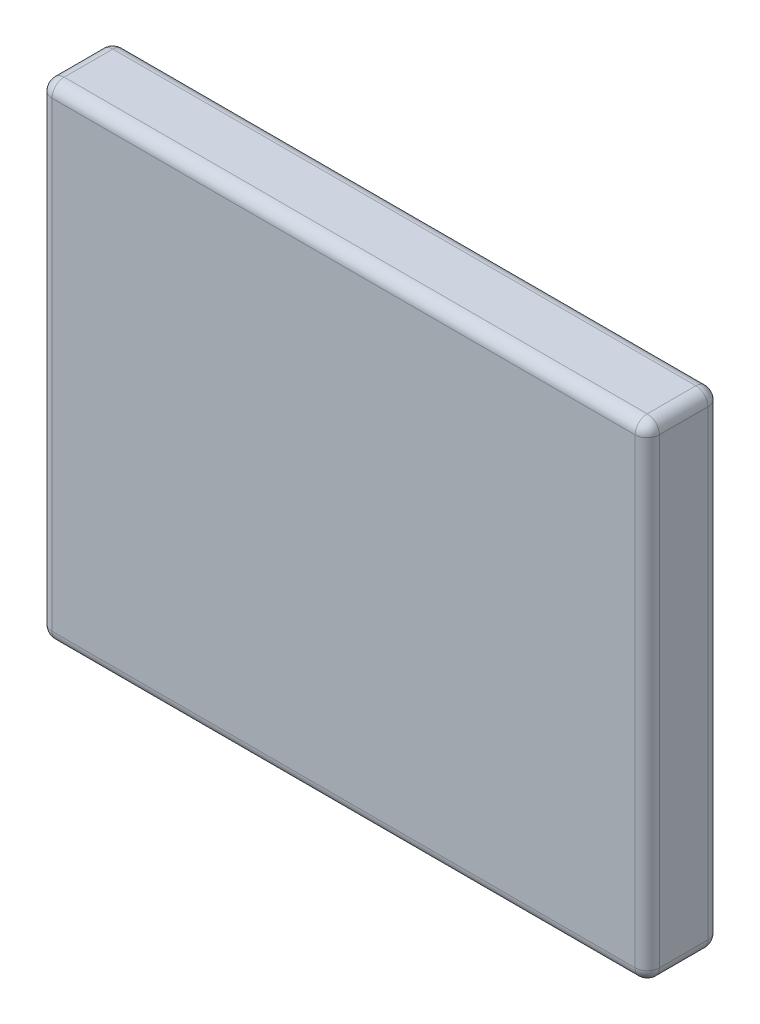
ISO-10303-21;
HEADER;
FILE_DESCRIPTION(('STEP AP214'),'2;1');
FILE_NAME('part.step','',(''),(''),'','','');
FILE_SCHEMA(('AUTOMOTIVE_DESIGN { 1 0 10303 214 1 1 1 1 }'));
ENDSEC;
DATA;
#1=APPLICATION_CONTEXT('core data for automotive mechanical design processes');
#2=APPLICATION_PROTOCOL_DEFINITION('international standard','automotive_design',2000,#1);
#3=PRODUCT_CONTEXT('',#1,'mechanical');
#4=PRODUCT('Part','Part','',(#3));
#5=PRODUCT_RELATED_PRODUCT_CATEGORY('part','',(#4));
#6=PRODUCT_DEFINITION_FORMATION('','',#4);
#7=PRODUCT_DEFINITION_CONTEXT('part definition',#1,'design');
#8=PRODUCT_DEFINITION('design','',#6,#7);
#9=PRODUCT_DEFINITION_SHAPE('','',#8);
#10=(LENGTH_UNIT() NAMED_UNIT(*) SI_UNIT(.MILLI.,.METRE.));
#11=(NAMED_UNIT(*) PLANE_ANGLE_UNIT() SI_UNIT($,.RADIAN.));
#12=(NAMED_UNIT(*) SI_UNIT($,.STERADIAN.) SOLID_ANGLE_UNIT());
#13=UNCERTAINTY_MEASURE_WITH_UNIT(LENGTH_MEASURE(1.E-05),#10,'distance_accuracy_value','');
#14=(GEOMETRIC_REPRESENTATION_CONTEXT(3) GLOBAL_UNCERTAINTY_ASSIGNED_CONTEXT((#13)) GLOBAL_UNIT_ASSIGNED_CONTEXT((#10,
#11,#12)) REPRESENTATION_CONTEXT('',''));
#15=CARTESIAN_POINT('',(0.,0.,0.));
#16=DIRECTION('',(0.,0.,1.));
#17=DIRECTION('',(1.,0.,0.));
#18=AXIS2_PLACEMENT_3D('',#15,#16,#17);
#19=CARTESIAN_POINT('',(-12.5,10.,3.));
#20=DIRECTION('',(0.,1.,0.));
#21=DIRECTION('',(-1.,0.,0.));
#22=AXIS2_PLACEMENT_3D('',#19,#20,#21);
#23=PLANE('',#22);
#24=DIRECTION('',(1.,0.,0.));
#25=VECTOR('',#24,1.);
#26=CARTESIAN_POINT('',(12.5,10.,2.5));
#27=LINE('',#26,#25);
#28=CARTESIAN_POINT('',(-12.,10.,2.5));
#29=VERTEX_POINT('',#28);
#30=CARTESIAN_POINT('',(12.,10.,2.5));
#31=VERTEX_POINT('',#30);
#32=EDGE_CURVE('E130',#29,#31,#27,.T.);
#33=ORIENTED_EDGE('',*,*,#32,.T.);
#34=DIRECTION('',(0.,0.,-1.));
#35=VECTOR('',#34,1.);
#36=CARTESIAN_POINT('',(12.,10.,3.));
#37=LINE('',#36,#35);
#38=CARTESIAN_POINT('',(12.,10.,0.5));
#39=VERTEX_POINT('',#38);
#40=EDGE_CURVE('E126',#31,#39,#37,.T.);
#41=ORIENTED_EDGE('',*,*,#40,.T.);
#42=DIRECTION('',(1.,0.,0.));
#43=VECTOR('',#42,1.);
#44=CARTESIAN_POINT('',(-12.5,10.,0.5));
#45=LINE('',#44,#43);
#46=CARTESIAN_POINT('',(-12.,10.,0.5));
#47=VERTEX_POINT('',#46);
#48=EDGE_CURVE('E121',#39,#47,#45,.F.);
#49=ORIENTED_EDGE('',*,*,#48,.T.);
#50=DIRECTION('',(0.,0.,-1.));
#51=VECTOR('',#50,1.);
#52=CARTESIAN_POINT('',(-12.,10.,3.));
#53=LINE('',#52,#51);
#54=EDGE_CURVE('E123',#47,#29,#53,.F.);
#55=ORIENTED_EDGE('',*,*,#54,.T.);
#56=EDGE_LOOP('',(#33,#41,#49,#55));
#57=FACE_BOUND('',#56,.T.);
#58=ADVANCED_FACE('F32',(#57),#23,.T.);
#59=CARTESIAN_POINT('',(-12.5,10.,3.));
#60=DIRECTION('',(1.,0.,0.));
#61=DIRECTION('',(0.,1.,0.));
#62=AXIS2_PLACEMENT_3D('',#59,#60,#61);
#63=PLANE('',#62);
#64=DIRECTION('',(0.,-1.,0.));
#65=VECTOR('',#64,1.);
#66=CARTESIAN_POINT('',(-12.5,-10.,0.5));
#67=LINE('',#66,#65);
#68=CARTESIAN_POINT('',(-12.5,9.5,0.5));
#69=VERTEX_POINT('',#68);
#70=CARTESIAN_POINT('',(-12.5,-9.5,0.5));
#71=VERTEX_POINT('',#70);
#72=EDGE_CURVE('E260',#69,#71,#67,.T.);
#73=ORIENTED_EDGE('',*,*,#72,.T.);
#74=DIRECTION('',(0.,0.,-1.));
#75=VECTOR('',#74,1.);
#76=CARTESIAN_POINT('',(-12.5,-9.5,3.));
#77=LINE('',#76,#75);
#78=CARTESIAN_POINT('',(-12.5,-9.5,2.5));
#79=VERTEX_POINT('',#78);
#80=EDGE_CURVE('E263',#71,#79,#77,.F.);
#81=ORIENTED_EDGE('',*,*,#80,.T.);
#82=DIRECTION('',(0.,-1.,0.));
#83=VECTOR('',#82,1.);
#84=CARTESIAN_POINT('',(-12.5,10.,2.5));
#85=LINE('',#84,#83);
#86=CARTESIAN_POINT('',(-12.5,9.5,2.5));
#87=VERTEX_POINT('',#86);
#88=EDGE_CURVE('E255',#79,#87,#85,.F.);
#89=ORIENTED_EDGE('',*,*,#88,.T.);
#90=DIRECTION('',(0.,0.,-1.));
#91=VECTOR('',#90,1.);
#92=CARTESIAN_POINT('',(-12.5,9.5,0.));
#93=LINE('',#92,#91);
#94=EDGE_CURVE('E253',#87,#69,#93,.T.);
#95=ORIENTED_EDGE('',*,*,#94,.T.);
#96=EDGE_LOOP('',(#73,#81,#89,#95));
#97=FACE_BOUND('',#96,.T.);
#98=ADVANCED_FACE('F314',(#97),#63,.F.);
#99=CARTESIAN_POINT('',(-12.5,-10.,3.));
#100=DIRECTION('',(0.,1.,0.));
#101=DIRECTION('',(-1.,0.,0.));
#102=AXIS2_PLACEMENT_3D('',#99,#100,#101);
#103=PLANE('',#102);
#104=DIRECTION('',(1.,0.,0.));
#105=VECTOR('',#104,1.);
#106=CARTESIAN_POINT('',(12.5,-10.,0.5));
#107=LINE('',#106,#105);
#108=CARTESIAN_POINT('',(-12.,-10.,0.5));
#109=VERTEX_POINT('',#108);
#110=CARTESIAN_POINT('',(12.,-10.,0.5));
#111=VERTEX_POINT('',#110);
#112=EDGE_CURVE('E276',#109,#111,#107,.T.);
#113=ORIENTED_EDGE('',*,*,#112,.T.);
#114=DIRECTION('',(0.,0.,-1.));
#115=VECTOR('',#114,1.);
#116=CARTESIAN_POINT('',(12.,-10.,3.));
#117=LINE('',#116,#115);
#118=CARTESIAN_POINT('',(12.,-10.,2.5));
#119=VERTEX_POINT('',#118);
#120=EDGE_CURVE('E279',#111,#119,#117,.F.);
#121=ORIENTED_EDGE('',*,*,#120,.T.);
#122=DIRECTION('',(1.,0.,0.));
#123=VECTOR('',#122,1.);
#124=CARTESIAN_POINT('',(-12.5,-10.,2.5));
#125=LINE('',#124,#123);
#126=CARTESIAN_POINT('',(-12.,-10.,2.5));
#127=VERTEX_POINT('',#126);
#128=EDGE_CURVE('E209',#119,#127,#125,.F.);
#129=ORIENTED_EDGE('',*,*,#128,.T.);
#130=DIRECTION('',(0.,0.,-1.));
#131=VECTOR('',#130,1.);
#132=CARTESIAN_POINT('',(-12.,-10.,3.));
#133=LINE('',#132,#131);
#134=EDGE_CURVE('E273',#127,#109,#133,.T.);
#135=ORIENTED_EDGE('',*,*,#134,.T.);
#136=EDGE_LOOP('',(#113,#121,#129,#135));
#137=FACE_BOUND('',#136,.T.);
#138=ADVANCED_FACE('F318',(#137),#103,.F.);
#139=CARTESIAN_POINT('',(12.5,10.,3.));
#140=DIRECTION('',(1.,0.,0.));
#141=DIRECTION('',(0.,1.,0.));
#142=AXIS2_PLACEMENT_3D('',#139,#140,#141);
#143=PLANE('',#142);
#144=DIRECTION('',(0.,-1.,0.));
#145=VECTOR('',#144,1.);
#146=CARTESIAN_POINT('',(12.5,10.,0.5));
#147=LINE('',#146,#145);
#148=CARTESIAN_POINT('',(12.5,-9.5,0.5));
#149=VERTEX_POINT('',#148);
#150=CARTESIAN_POINT('',(12.5,9.5,0.5));
#151=VERTEX_POINT('',#150);
#152=EDGE_CURVE('E243',#149,#151,#147,.F.);
#153=ORIENTED_EDGE('',*,*,#152,.T.);
#154=DIRECTION('',(0.,0.,-1.));
#155=VECTOR('',#154,1.);
#156=CARTESIAN_POINT('',(12.5,9.5,3.));
#157=LINE('',#156,#155);
#158=CARTESIAN_POINT('',(12.5,9.5,2.5));
#159=VERTEX_POINT('',#158);
#160=EDGE_CURVE('E247',#151,#159,#157,.F.);
#161=ORIENTED_EDGE('',*,*,#160,.T.);
#162=DIRECTION('',(0.,-1.,0.));
#163=VECTOR('',#162,1.);
#164=CARTESIAN_POINT('',(12.5,-10.,2.5));
#165=LINE('',#164,#163);
#166=CARTESIAN_POINT('',(12.5,-9.5,2.5));
#167=VERTEX_POINT('',#166);
#168=EDGE_CURVE('E238',#159,#167,#165,.T.);
#169=ORIENTED_EDGE('',*,*,#168,.T.);
#170=DIRECTION('',(0.,0.,-1.));
#171=VECTOR('',#170,1.);
#172=CARTESIAN_POINT('',(12.5,-9.5,0.));
#173=LINE('',#172,#171);
#174=EDGE_CURVE('E244',#167,#149,#173,.T.);
#175=ORIENTED_EDGE('',*,*,#174,.T.);
#176=EDGE_LOOP('',(#153,#161,#169,#175));
#177=FACE_BOUND('',#176,.T.);
#178=ADVANCED_FACE('F248',(#177),#143,.T.);
#179=CARTESIAN_POINT('',(0.,0.,3.));
#180=DIRECTION('',(0.,0.,-1.));
#181=DIRECTION('',(-1.,0.,0.));
#182=AXIS2_PLACEMENT_3D('',#179,#180,#181);
#183=PLANE('',#182);
#184=DIRECTION('',(1.,0.,0.));
#185=VECTOR('',#184,1.);
#186=CARTESIAN_POINT('',(0.,-9.5,3.));
#187=LINE('',#186,#185);
#188=CARTESIAN_POINT('',(-12.,-9.5,3.));
#189=VERTEX_POINT('',#188);
#190=CARTESIAN_POINT('',(12.,-9.5,3.));
#191=VERTEX_POINT('',#190);
#192=EDGE_CURVE('E41',#189,#191,#187,.T.);
#193=ORIENTED_EDGE('',*,*,#192,.T.);
#194=DIRECTION('',(0.,-1.,0.));
#195=VECTOR('',#194,1.);
#196=CARTESIAN_POINT('',(12.,10.,3.));
#197=LINE('',#196,#195);
#198=CARTESIAN_POINT('',(12.,9.5,3.));
#199=VERTEX_POINT('',#198);
#200=EDGE_CURVE('E11',#191,#199,#197,.F.);
#201=ORIENTED_EDGE('',*,*,#200,.T.);
#202=DIRECTION('',(1.,0.,0.));
#203=VECTOR('',#202,1.);
#204=CARTESIAN_POINT('',(-12.5,9.5,3.));
#205=LINE('',#204,#203);
#206=CARTESIAN_POINT('',(-12.,9.5,3.));
#207=VERTEX_POINT('',#206);
#208=EDGE_CURVE('E213',#199,#207,#205,.F.);
#209=ORIENTED_EDGE('',*,*,#208,.T.);
#210=DIRECTION('',(0.,-1.,0.));
#211=VECTOR('',#210,1.);
#212=CARTESIAN_POINT('',(-12.,0.,3.));
#213=LINE('',#212,#211);
#214=EDGE_CURVE('E52',#207,#189,#213,.T.);
#215=ORIENTED_EDGE('',*,*,#214,.T.);
#216=EDGE_LOOP('',(#193,#201,#209,#215));
#217=FACE_BOUND('',#216,.T.);
#218=ADVANCED_FACE('F280',(#217),#183,.F.);
#219=CARTESIAN_POINT('',(0.,0.,0.));
#220=DIRECTION('',(0.,0.,-1.));
#221=DIRECTION('',(-1.,0.,0.));
#222=AXIS2_PLACEMENT_3D('',#219,#220,#221);
#223=PLANE('',#222);
#224=DIRECTION('',(1.,0.,0.));
#225=VECTOR('',#224,1.);
#226=CARTESIAN_POINT('',(-12.5,-9.5,0.));
#227=LINE('',#226,#225);
#228=CARTESIAN_POINT('',(12.,-9.5,0.));
#229=VERTEX_POINT('',#228);
#230=CARTESIAN_POINT('',(-12.,-9.5,0.));
#231=VERTEX_POINT('',#230);
#232=EDGE_CURVE('E268',#229,#231,#227,.F.);
#233=ORIENTED_EDGE('',*,*,#232,.T.);
#234=DIRECTION('',(0.,-1.,0.));
#235=VECTOR('',#234,1.);
#236=CARTESIAN_POINT('',(-12.,10.,0.));
#237=LINE('',#236,#235);
#238=CARTESIAN_POINT('',(-12.,9.5,0.));
#239=VERTEX_POINT('',#238);
#240=EDGE_CURVE('E270',#231,#239,#237,.F.);
#241=ORIENTED_EDGE('',*,*,#240,.T.);
#242=DIRECTION('',(1.,0.,0.));
#243=VECTOR('',#242,1.);
#244=CARTESIAN_POINT('',(0.,9.5,0.));
#245=LINE('',#244,#243);
#246=CARTESIAN_POINT('',(12.,9.5,0.));
#247=VERTEX_POINT('',#246);
#248=EDGE_CURVE('E151',#239,#247,#245,.T.);
#249=ORIENTED_EDGE('',*,*,#248,.T.);
#250=DIRECTION('',(0.,-1.,0.));
#251=VECTOR('',#250,1.);
#252=CARTESIAN_POINT('',(12.,0.,0.));
#253=LINE('',#252,#251);
#254=EDGE_CURVE('E266',#247,#229,#253,.T.);
#255=ORIENTED_EDGE('',*,*,#254,.T.);
#256=EDGE_LOOP('',(#233,#241,#249,#255));
#257=FACE_BOUND('',#256,.T.);
#258=ADVANCED_FACE('F327',(#257),#223,.T.);
#259=CARTESIAN_POINT('',(-12.,-9.5,3.));
#260=DIRECTION('',(0.,0.,-1.));
#261=DIRECTION('',(-1.,0.,0.));
#262=AXIS2_PLACEMENT_3D('',#259,#260,#261);
#263=CYLINDRICAL_SURFACE('',#262,0.5);
#264=CARTESIAN_POINT('',(-12.,-9.5,2.5));
#265=DIRECTION('',(0.,0.,1.));
#266=DIRECTION('',(1.,0.,0.));
#267=AXIS2_PLACEMENT_3D('',#264,#265,#266);
#268=CIRCLE('',#267,0.5);
#269=EDGE_CURVE('E36',#79,#127,#268,.T.);
#270=ORIENTED_EDGE('',*,*,#269,.F.);
#271=ORIENTED_EDGE('',*,*,#80,.F.);
#272=CARTESIAN_POINT('',(-12.,-9.5,0.5));
#273=DIRECTION('',(0.,0.,-1.));
#274=DIRECTION('',(-1.,0.,0.));
#275=AXIS2_PLACEMENT_3D('',#272,#273,#274);
#276=CIRCLE('',#275,0.5);
#277=EDGE_CURVE('E190',#109,#71,#276,.T.);
#278=ORIENTED_EDGE('',*,*,#277,.F.);
#279=ORIENTED_EDGE('',*,*,#134,.F.);
#280=EDGE_LOOP('',(#270,#271,#278,#279));
#281=FACE_BOUND('',#280,.T.);
#282=ADVANCED_FACE('F34',(#281),#263,.T.);
#283=CARTESIAN_POINT('',(-12.,-9.5,2.5));
#284=DIRECTION('',(0.,-1.,0.));
#285=DIRECTION('',(0.,0.,-1.));
#286=AXIS2_PLACEMENT_3D('',#283,#284,#285);
#287=SPHERICAL_SURFACE('',#286,0.5);
#288=CARTESIAN_POINT('',(-12.,-9.5,2.5));
#289=DIRECTION('',(0.,-1.,0.));
#290=DIRECTION('',(0.,0.,-1.));
#291=AXIS2_PLACEMENT_3D('',#288,#289,#290);
#292=CIRCLE('',#291,0.5);
#293=EDGE_CURVE('E186',#79,#189,#292,.F.);
#294=ORIENTED_EDGE('',*,*,#293,.F.);
#295=ORIENTED_EDGE('',*,*,#269,.T.);
#296=CARTESIAN_POINT('',(-12.,-9.5,2.5));
#297=DIRECTION('',(-1.,0.,0.));
#298=DIRECTION('',(0.,0.,1.));
#299=AXIS2_PLACEMENT_3D('',#296,#297,#298);
#300=CIRCLE('',#299,0.5);
#301=EDGE_CURVE('E188',#189,#127,#300,.F.);
#302=ORIENTED_EDGE('',*,*,#301,.F.);
#303=EDGE_LOOP('',(#294,#295,#302));
#304=FACE_BOUND('',#303,.T.);
#305=ADVANCED_FACE('F202',(#304),#287,.T.);
#306=CARTESIAN_POINT('',(-12.,-9.5,0.5));
#307=DIRECTION('',(-1.,0.,0.));
#308=DIRECTION('',(0.,0.,1.));
#309=AXIS2_PLACEMENT_3D('',#306,#307,#308);
#310=SPHERICAL_SURFACE('',#309,0.5);
#311=CARTESIAN_POINT('',(-12.,-9.5,0.5));
#312=DIRECTION('',(-1.,0.,0.));
#313=DIRECTION('',(0.,0.,1.));
#314=AXIS2_PLACEMENT_3D('',#311,#312,#313);
#315=CIRCLE('',#314,0.5);
#316=EDGE_CURVE('E181',#109,#231,#315,.F.);
#317=ORIENTED_EDGE('',*,*,#316,.F.);
#318=ORIENTED_EDGE('',*,*,#277,.T.);
#319=CARTESIAN_POINT('',(-12.,-9.5,0.5));
#320=DIRECTION('',(0.,-1.,0.));
#321=DIRECTION('',(0.,0.,-1.));
#322=AXIS2_PLACEMENT_3D('',#319,#320,#321);
#323=CIRCLE('',#322,0.5);
#324=EDGE_CURVE('E184',#231,#71,#323,.F.);
#325=ORIENTED_EDGE('',*,*,#324,.F.);
#326=EDGE_LOOP('',(#317,#318,#325));
#327=FACE_BOUND('',#326,.T.);
#328=ADVANCED_FACE('F351',(#327),#310,.T.);
#329=CARTESIAN_POINT('',(0.,-9.5,2.5));
#330=DIRECTION('',(1.,0.,0.));
#331=DIRECTION('',(0.,1.,0.));
#332=AXIS2_PLACEMENT_3D('',#329,#330,#331);
#333=CYLINDRICAL_SURFACE('',#332,0.5);
#334=ORIENTED_EDGE('',*,*,#301,.T.);
#335=ORIENTED_EDGE('',*,*,#128,.F.);
#336=CARTESIAN_POINT('',(12.,-9.5,2.5));
#337=DIRECTION('',(1.,0.,0.));
#338=DIRECTION('',(0.,0.,-1.));
#339=AXIS2_PLACEMENT_3D('',#336,#337,#338);
#340=CIRCLE('',#339,0.5);
#341=EDGE_CURVE('E175',#191,#119,#340,.T.);
#342=ORIENTED_EDGE('',*,*,#341,.F.);
#343=ORIENTED_EDGE('',*,*,#192,.F.);
#344=EDGE_LOOP('',(#334,#335,#342,#343));
#345=FACE_BOUND('',#344,.T.);
#346=ADVANCED_FACE('F208',(#345),#333,.T.);
#347=CARTESIAN_POINT('',(-12.,0.,2.5));
#348=DIRECTION('',(0.,-1.,0.));
#349=DIRECTION('',(1.,0.,0.));
#350=AXIS2_PLACEMENT_3D('',#347,#348,#349);
#351=CYLINDRICAL_SURFACE('',#350,0.5);
#352=ORIENTED_EDGE('',*,*,#293,.T.);
#353=ORIENTED_EDGE('',*,*,#214,.F.);
#354=CARTESIAN_POINT('',(-12.,9.5,2.5));
#355=DIRECTION('',(0.,1.,0.));
#356=DIRECTION('',(0.,0.,1.));
#357=AXIS2_PLACEMENT_3D('',#354,#355,#356);
#358=CIRCLE('',#357,0.5);
#359=EDGE_CURVE('E172',#87,#207,#358,.T.);
#360=ORIENTED_EDGE('',*,*,#359,.F.);
#361=ORIENTED_EDGE('',*,*,#88,.F.);
#362=EDGE_LOOP('',(#352,#353,#360,#361));
#363=FACE_BOUND('',#362,.T.);
#364=ADVANCED_FACE('F284',(#363),#351,.T.);
#365=CARTESIAN_POINT('',(-12.,9.5,3.));
#366=DIRECTION('',(0.,0.,1.));
#367=DIRECTION('',(1.,0.,0.));
#368=AXIS2_PLACEMENT_3D('',#365,#366,#367);
#369=CYLINDRICAL_SURFACE('',#368,0.5);
#370=CARTESIAN_POINT('',(-12.,9.5,0.5));
#371=DIRECTION('',(0.,0.,-1.));
#372=DIRECTION('',(-1.,0.,0.));
#373=AXIS2_PLACEMENT_3D('',#370,#371,#372);
#374=CIRCLE('',#373,0.5);
#375=EDGE_CURVE('E137',#69,#47,#374,.T.);
#376=ORIENTED_EDGE('',*,*,#375,.F.);
#377=ORIENTED_EDGE('',*,*,#94,.F.);
#378=CARTESIAN_POINT('',(-12.,9.5,2.5));
#379=DIRECTION('',(0.,0.,1.));
#380=DIRECTION('',(1.,0.,0.));
#381=AXIS2_PLACEMENT_3D('',#378,#379,#380);
#382=CIRCLE('',#381,0.5);
#383=EDGE_CURVE('E140',#29,#87,#382,.T.);
#384=ORIENTED_EDGE('',*,*,#383,.F.);
#385=ORIENTED_EDGE('',*,*,#54,.F.);
#386=EDGE_LOOP('',(#376,#377,#384,#385));
#387=FACE_BOUND('',#386,.T.);
#388=ADVANCED_FACE('F135',(#387),#369,.T.);
#389=CARTESIAN_POINT('',(-12.,10.,0.5));
#390=DIRECTION('',(0.,1.,0.));
#391=DIRECTION('',(-1.,0.,0.));
#392=AXIS2_PLACEMENT_3D('',#389,#390,#391);
#393=CYLINDRICAL_SURFACE('',#392,0.5);
#394=ORIENTED_EDGE('',*,*,#324,.T.);
#395=ORIENTED_EDGE('',*,*,#72,.F.);
#396=CARTESIAN_POINT('',(-12.,9.5,0.5));
#397=DIRECTION('',(0.,1.,0.));
#398=DIRECTION('',(0.,0.,1.));
#399=AXIS2_PLACEMENT_3D('',#396,#397,#398);
#400=CIRCLE('',#399,0.5);
#401=EDGE_CURVE('E148',#239,#69,#400,.T.);
#402=ORIENTED_EDGE('',*,*,#401,.F.);
#403=ORIENTED_EDGE('',*,*,#240,.F.);
#404=EDGE_LOOP('',(#394,#395,#402,#403));
#405=FACE_BOUND('',#404,.T.);
#406=ADVANCED_FACE('F375',(#405),#393,.T.);
#407=CARTESIAN_POINT('',(-12.5,-9.5,0.5));
#408=DIRECTION('',(-1.,0.,0.));
#409=DIRECTION('',(0.,-1.,0.));
#410=AXIS2_PLACEMENT_3D('',#407,#408,#409);
#411=CYLINDRICAL_SURFACE('',#410,0.5);
#412=ORIENTED_EDGE('',*,*,#316,.T.);
#413=ORIENTED_EDGE('',*,*,#232,.F.);
#414=CARTESIAN_POINT('',(12.,-9.5,0.5));
#415=DIRECTION('',(1.,0.,0.));
#416=DIRECTION('',(0.,0.,-1.));
#417=AXIS2_PLACEMENT_3D('',#414,#415,#416);
#418=CIRCLE('',#417,0.5);
#419=EDGE_CURVE('E167',#111,#229,#418,.T.);
#420=ORIENTED_EDGE('',*,*,#419,.F.);
#421=ORIENTED_EDGE('',*,*,#112,.F.);
#422=EDGE_LOOP('',(#412,#413,#420,#421));
#423=FACE_BOUND('',#422,.T.);
#424=ADVANCED_FACE('F382',(#423),#411,.T.);
#425=CARTESIAN_POINT('',(12.,-9.5,3.));
#426=DIRECTION('',(0.,0.,1.));
#427=DIRECTION('',(1.,0.,0.));
#428=AXIS2_PLACEMENT_3D('',#425,#426,#427);
#429=CYLINDRICAL_SURFACE('',#428,0.5);
#430=CARTESIAN_POINT('',(12.,-9.5,2.5));
#431=DIRECTION('',(0.,0.,1.));
#432=DIRECTION('',(1.,0.,0.));
#433=AXIS2_PLACEMENT_3D('',#430,#431,#432);
#434=CIRCLE('',#433,0.5);
#435=EDGE_CURVE('E178',#119,#167,#434,.T.);
#436=ORIENTED_EDGE('',*,*,#435,.F.);
#437=ORIENTED_EDGE('',*,*,#120,.F.);
#438=CARTESIAN_POINT('',(12.,-9.5,0.5));
#439=DIRECTION('',(0.,0.,-1.));
#440=DIRECTION('',(-1.,0.,0.));
#441=AXIS2_PLACEMENT_3D('',#438,#439,#440);
#442=CIRCLE('',#441,0.5);
#443=EDGE_CURVE('E165',#149,#111,#442,.T.);
#444=ORIENTED_EDGE('',*,*,#443,.F.);
#445=ORIENTED_EDGE('',*,*,#174,.F.);
#446=EDGE_LOOP('',(#436,#437,#444,#445));
#447=FACE_BOUND('',#446,.T.);
#448=ADVANCED_FACE('F296',(#447),#429,.T.);
#449=CARTESIAN_POINT('',(12.,-9.5,2.5));
#450=DIRECTION('',(0.,-1.,0.));
#451=DIRECTION('',(0.,0.,-1.));
#452=AXIS2_PLACEMENT_3D('',#449,#450,#451);
#453=SPHERICAL_SURFACE('',#452,0.5);
#454=ORIENTED_EDGE('',*,*,#341,.T.);
#455=ORIENTED_EDGE('',*,*,#435,.T.);
#456=CARTESIAN_POINT('',(12.,-9.5,2.5));
#457=DIRECTION('',(0.,-1.,0.));
#458=DIRECTION('',(0.,0.,-1.));
#459=AXIS2_PLACEMENT_3D('',#456,#457,#458);
#460=CIRCLE('',#459,0.5);
#461=EDGE_CURVE('E156',#191,#167,#460,.F.);
#462=ORIENTED_EDGE('',*,*,#461,.F.);
#463=EDGE_LOOP('',(#454,#455,#462));
#464=FACE_BOUND('',#463,.T.);
#465=ADVANCED_FACE('F397',(#464),#453,.T.);
#466=CARTESIAN_POINT('',(-12.,9.5,2.5));
#467=DIRECTION('',(-1.,0.,0.));
#468=DIRECTION('',(0.,0.,1.));
#469=AXIS2_PLACEMENT_3D('',#466,#467,#468);
#470=SPHERICAL_SURFACE('',#469,0.5);
#471=ORIENTED_EDGE('',*,*,#383,.T.);
#472=ORIENTED_EDGE('',*,*,#359,.T.);
#473=CARTESIAN_POINT('',(-12.,9.5,2.5));
#474=DIRECTION('',(-1.,0.,0.));
#475=DIRECTION('',(0.,-1.,0.));
#476=AXIS2_PLACEMENT_3D('',#473,#474,#475);
#477=CIRCLE('',#476,0.5);
#478=EDGE_CURVE('E152',#29,#207,#477,.F.);
#479=ORIENTED_EDGE('',*,*,#478,.F.);
#480=EDGE_LOOP('',(#471,#472,#479));
#481=FACE_BOUND('',#480,.T.);
#482=ADVANCED_FACE('F286',(#481),#470,.T.);
#483=CARTESIAN_POINT('',(-12.,9.5,0.5));
#484=DIRECTION('',(-1.,0.,0.));
#485=DIRECTION('',(0.,0.,1.));
#486=AXIS2_PLACEMENT_3D('',#483,#484,#485);
#487=SPHERICAL_SURFACE('',#486,0.5);
#488=ORIENTED_EDGE('',*,*,#401,.T.);
#489=ORIENTED_EDGE('',*,*,#375,.T.);
#490=CARTESIAN_POINT('',(-12.,9.5,0.5));
#491=DIRECTION('',(-1.,0.,0.));
#492=DIRECTION('',(0.,0.,1.));
#493=AXIS2_PLACEMENT_3D('',#490,#491,#492);
#494=CIRCLE('',#493,0.5);
#495=EDGE_CURVE('E146',#239,#47,#494,.F.);
#496=ORIENTED_EDGE('',*,*,#495,.F.);
#497=EDGE_LOOP('',(#488,#489,#496));
#498=FACE_BOUND('',#497,.T.);
#499=ADVANCED_FACE('F145',(#498),#487,.T.);
#500=CARTESIAN_POINT('',(12.,-9.5,0.5));
#501=DIRECTION('',(0.,-1.,0.));
#502=DIRECTION('',(0.,0.,-1.));
#503=AXIS2_PLACEMENT_3D('',#500,#501,#502);
#504=SPHERICAL_SURFACE('',#503,0.5);
#505=ORIENTED_EDGE('',*,*,#443,.T.);
#506=ORIENTED_EDGE('',*,*,#419,.T.);
#507=CARTESIAN_POINT('',(12.,-9.5,0.5));
#508=DIRECTION('',(0.,-1.,0.));
#509=DIRECTION('',(0.,0.,-1.));
#510=AXIS2_PLACEMENT_3D('',#507,#508,#509);
#511=CIRCLE('',#510,0.5);
#512=EDGE_CURVE('E153',#149,#229,#511,.F.);
#513=ORIENTED_EDGE('',*,*,#512,.F.);
#514=EDGE_LOOP('',(#505,#506,#513));
#515=FACE_BOUND('',#514,.T.);
#516=ADVANCED_FACE('F299',(#515),#504,.T.);
#517=CARTESIAN_POINT('',(12.,10.,2.5));
#518=DIRECTION('',(0.,1.,0.));
#519=DIRECTION('',(-1.,0.,0.));
#520=AXIS2_PLACEMENT_3D('',#517,#518,#519);
#521=CYLINDRICAL_SURFACE('',#520,0.5);
#522=ORIENTED_EDGE('',*,*,#461,.T.);
#523=ORIENTED_EDGE('',*,*,#168,.F.);
#524=CARTESIAN_POINT('',(12.,9.5,2.5));
#525=DIRECTION('',(0.,1.,0.));
#526=DIRECTION('',(0.,0.,1.));
#527=AXIS2_PLACEMENT_3D('',#524,#525,#526);
#528=CIRCLE('',#527,0.5);
#529=EDGE_CURVE('E159',#199,#159,#528,.T.);
#530=ORIENTED_EDGE('',*,*,#529,.F.);
#531=ORIENTED_EDGE('',*,*,#200,.F.);
#532=EDGE_LOOP('',(#522,#523,#530,#531));
#533=FACE_BOUND('',#532,.T.);
#534=ADVANCED_FACE('F240',(#533),#521,.T.);
#535=CARTESIAN_POINT('',(-12.5,9.5,2.5));
#536=DIRECTION('',(-1.,0.,0.));
#537=DIRECTION('',(0.,-1.,0.));
#538=AXIS2_PLACEMENT_3D('',#535,#536,#537);
#539=CYLINDRICAL_SURFACE('',#538,0.5);
#540=ORIENTED_EDGE('',*,*,#478,.T.);
#541=ORIENTED_EDGE('',*,*,#208,.F.);
#542=CARTESIAN_POINT('',(12.,9.5,2.5));
#543=DIRECTION('',(1.,0.,0.));
#544=DIRECTION('',(0.,0.,-1.));
#545=AXIS2_PLACEMENT_3D('',#542,#543,#544);
#546=CIRCLE('',#545,0.5);
#547=EDGE_CURVE('E227',#31,#199,#546,.T.);
#548=ORIENTED_EDGE('',*,*,#547,.F.);
#549=ORIENTED_EDGE('',*,*,#32,.F.);
#550=EDGE_LOOP('',(#540,#541,#548,#549));
#551=FACE_BOUND('',#550,.T.);
#552=ADVANCED_FACE('F288',(#551),#539,.T.);
#553=CARTESIAN_POINT('',(0.,9.5,0.5));
#554=DIRECTION('',(1.,0.,0.));
#555=DIRECTION('',(0.,1.,0.));
#556=AXIS2_PLACEMENT_3D('',#553,#554,#555);
#557=CYLINDRICAL_SURFACE('',#556,0.5);
#558=ORIENTED_EDGE('',*,*,#495,.T.);
#559=ORIENTED_EDGE('',*,*,#48,.F.);
#560=CARTESIAN_POINT('',(12.,9.5,0.5));
#561=DIRECTION('',(1.,0.,0.));
#562=DIRECTION('',(0.,1.,0.));
#563=AXIS2_PLACEMENT_3D('',#560,#561,#562);
#564=CIRCLE('',#563,0.5);
#565=EDGE_CURVE('E224',#247,#39,#564,.T.);
#566=ORIENTED_EDGE('',*,*,#565,.F.);
#567=ORIENTED_EDGE('',*,*,#248,.F.);
#568=EDGE_LOOP('',(#558,#559,#566,#567));
#569=FACE_BOUND('',#568,.T.);
#570=ADVANCED_FACE('F150',(#569),#557,.T.);
#571=CARTESIAN_POINT('',(12.,0.,0.5));
#572=DIRECTION('',(0.,-1.,0.));
#573=DIRECTION('',(1.,0.,0.));
#574=AXIS2_PLACEMENT_3D('',#571,#572,#573);
#575=CYLINDRICAL_SURFACE('',#574,0.5);
#576=ORIENTED_EDGE('',*,*,#512,.T.);
#577=ORIENTED_EDGE('',*,*,#254,.F.);
#578=CARTESIAN_POINT('',(12.,9.5,0.5));
#579=DIRECTION('',(0.,1.,0.));
#580=DIRECTION('',(0.,0.,1.));
#581=AXIS2_PLACEMENT_3D('',#578,#579,#580);
#582=CIRCLE('',#581,0.5);
#583=EDGE_CURVE('E221',#151,#247,#582,.T.);
#584=ORIENTED_EDGE('',*,*,#583,.F.);
#585=ORIENTED_EDGE('',*,*,#152,.F.);
#586=EDGE_LOOP('',(#576,#577,#584,#585));
#587=FACE_BOUND('',#586,.T.);
#588=ADVANCED_FACE('F302',(#587),#575,.T.);
#589=CARTESIAN_POINT('',(12.,9.5,2.5));
#590=DIRECTION('',(0.,0.,1.));
#591=DIRECTION('',(1.,0.,0.));
#592=AXIS2_PLACEMENT_3D('',#589,#590,#591);
#593=SPHERICAL_SURFACE('',#592,0.5);
#594=ORIENTED_EDGE('',*,*,#547,.T.);
#595=ORIENTED_EDGE('',*,*,#529,.T.);
#596=CARTESIAN_POINT('',(12.,9.5,2.5));
#597=DIRECTION('',(0.,0.,1.));
#598=DIRECTION('',(1.,0.,0.));
#599=AXIS2_PLACEMENT_3D('',#596,#597,#598);
#600=CIRCLE('',#599,0.5);
#601=EDGE_CURVE('E219',#31,#159,#600,.F.);
#602=ORIENTED_EDGE('',*,*,#601,.F.);
#603=EDGE_LOOP('',(#594,#595,#602));
#604=FACE_BOUND('',#603,.T.);
#605=ADVANCED_FACE('F233',(#604),#593,.T.);
#606=CARTESIAN_POINT('',(12.,9.5,0.5));
#607=DIRECTION('',(0.,0.,-1.));
#608=DIRECTION('',(-1.,0.,0.));
#609=AXIS2_PLACEMENT_3D('',#606,#607,#608);
#610=SPHERICAL_SURFACE('',#609,0.5);
#611=ORIENTED_EDGE('',*,*,#583,.T.);
#612=ORIENTED_EDGE('',*,*,#565,.T.);
#613=CARTESIAN_POINT('',(12.,9.5,0.5));
#614=DIRECTION('',(0.,0.,-1.));
#615=DIRECTION('',(-1.,0.,0.));
#616=AXIS2_PLACEMENT_3D('',#613,#614,#615);
#617=CIRCLE('',#616,0.5);
#618=EDGE_CURVE('E217',#151,#39,#617,.F.);
#619=ORIENTED_EDGE('',*,*,#618,.F.);
#620=EDGE_LOOP('',(#611,#612,#619));
#621=FACE_BOUND('',#620,.T.);
#622=ADVANCED_FACE('F304',(#621),#610,.T.);
#623=CARTESIAN_POINT('',(12.,9.5,3.));
#624=DIRECTION('',(0.,0.,-1.));
#625=DIRECTION('',(-1.,0.,0.));
#626=AXIS2_PLACEMENT_3D('',#623,#624,#625);
#627=CYLINDRICAL_SURFACE('',#626,0.5);
#628=ORIENTED_EDGE('',*,*,#601,.T.);
#629=ORIENTED_EDGE('',*,*,#160,.F.);
#630=ORIENTED_EDGE('',*,*,#618,.T.);
#631=ORIENTED_EDGE('',*,*,#40,.F.);
#632=EDGE_LOOP('',(#628,#629,#630,#631));
#633=FACE_BOUND('',#632,.T.);
#634=ADVANCED_FACE('F305',(#633),#627,.T.);
#635=CLOSED_SHELL('',(#58,#98,#138,#178,#218,#258,#282,#305,#328,#346,#364,#388,#406,#424,#448,
#465,#482,#499,#516,#534,#552,#570,#588,#605,#622,#634));
#636=MANIFOLD_SOLID_BREP('B2',#635);
#637=ADVANCED_BREP_SHAPE_REPRESENTATION('',(#18,#636),#14);
#638=SHAPE_DEFINITION_REPRESENTATION(#9,#637);
ENDSEC;
END-ISO-10303-21;
